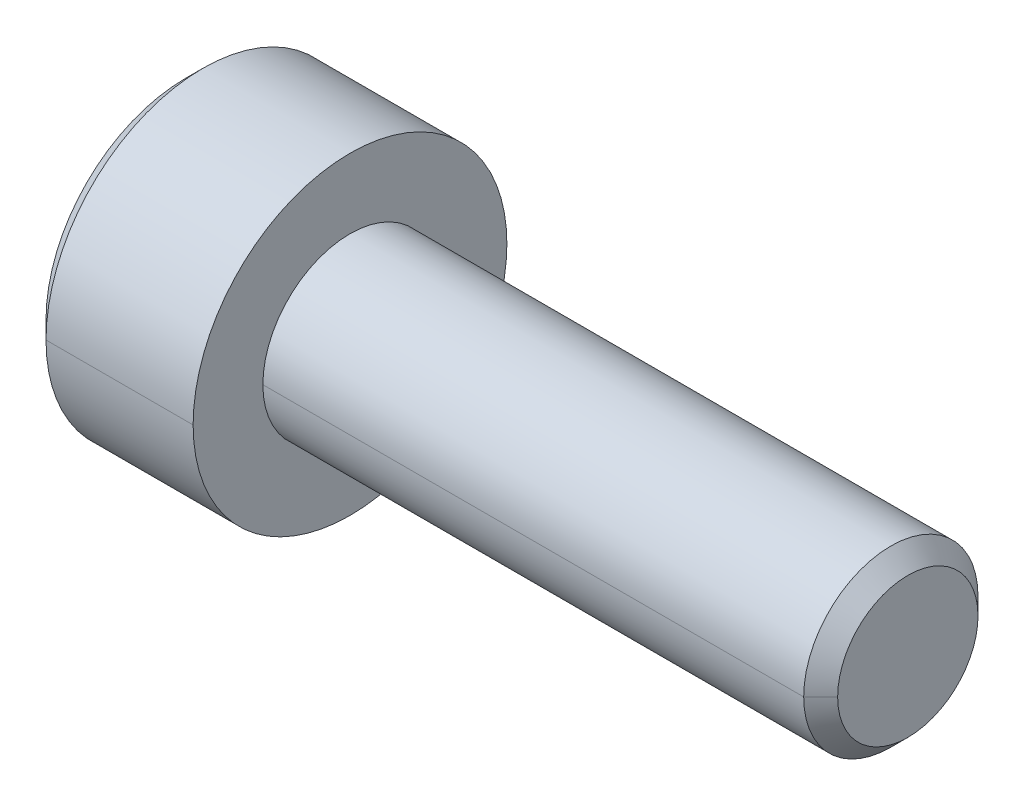
ISO-10303-21;
HEADER;
FILE_DESCRIPTION(('STEP AP214'),'2;1');
FILE_NAME('part.step','',(''),(''),'','','');
FILE_SCHEMA(('AUTOMOTIVE_DESIGN { 1 0 10303 214 1 1 1 1 }'));
ENDSEC;
DATA;
#1=APPLICATION_CONTEXT('core data for automotive mechanical design processes');
#2=APPLICATION_PROTOCOL_DEFINITION('international standard','automotive_design',2000,#1);
#3=PRODUCT_CONTEXT('',#1,'mechanical');
#4=PRODUCT('Part','Part','',(#3));
#5=PRODUCT_RELATED_PRODUCT_CATEGORY('part','',(#4));
#6=PRODUCT_DEFINITION_FORMATION('','',#4);
#7=PRODUCT_DEFINITION_CONTEXT('part definition',#1,'design');
#8=PRODUCT_DEFINITION('design','',#6,#7);
#9=PRODUCT_DEFINITION_SHAPE('','',#8);
#10=(LENGTH_UNIT() NAMED_UNIT(*) SI_UNIT(.MILLI.,.METRE.));
#11=(NAMED_UNIT(*) PLANE_ANGLE_UNIT() SI_UNIT($,.RADIAN.));
#12=(NAMED_UNIT(*) SI_UNIT($,.STERADIAN.) SOLID_ANGLE_UNIT());
#13=UNCERTAINTY_MEASURE_WITH_UNIT(LENGTH_MEASURE(1.E-05),#10,'distance_accuracy_value','');
#14=(GEOMETRIC_REPRESENTATION_CONTEXT(3) GLOBAL_UNCERTAINTY_ASSIGNED_CONTEXT((#13)) GLOBAL_UNIT_ASSIGNED_CONTEXT((#10,
#11,#12)) REPRESENTATION_CONTEXT('',''));
#15=CARTESIAN_POINT('',(0.,0.,0.));
#16=DIRECTION('',(0.,0.,1.));
#17=DIRECTION('',(1.,0.,0.));
#18=AXIS2_PLACEMENT_3D('',#15,#16,#17);
#19=CARTESIAN_POINT('',(-1.26,0.,0.));
#20=DIRECTION('',(1.,0.,0.));
#21=DIRECTION('',(0.,0.,-1.));
#22=AXIS2_PLACEMENT_3D('',#19,#20,#21);
#23=PLANE('',#22);
#24=CARTESIAN_POINT('',(-1.26,0.,0.));
#25=DIRECTION('',(-1.,0.,0.));
#26=DIRECTION('',(0.,0.,-1.));
#27=AXIS2_PLACEMENT_3D('',#24,#25,#26);
#28=CIRCLE('',#27,1.);
#29=CARTESIAN_POINT('',(-1.26,-0.866025403784422,-0.500000000000029));
#30=VERTEX_POINT('',#29);
#31=CARTESIAN_POINT('',(-1.26,-0.866025403784422,0.500000000000029));
#32=VERTEX_POINT('',#31);
#33=EDGE_CURVE('E11',#30,#32,#28,.T.);
#34=ORIENTED_EDGE('',*,*,#33,.F.);
#35=DIRECTION('',(0.,0.500000000000029,-0.866025403784422));
#36=VECTOR('',#35,1.);
#37=CARTESIAN_POINT('',(-1.26,-1.1547005383793,0.));
#38=LINE('',#37,#36);
#39=CARTESIAN_POINT('',(-1.26,-1.1547005383793,0.));
#40=VERTEX_POINT('',#39);
#41=EDGE_CURVE('E25',#40,#30,#38,.T.);
#42=ORIENTED_EDGE('',*,*,#41,.F.);
#43=DIRECTION('',(0.,-0.500000000000029,-0.866025403784422));
#44=VECTOR('',#43,1.);
#45=CARTESIAN_POINT('',(-1.26,-0.57735026918963,1.));
#46=LINE('',#45,#44);
#47=EDGE_CURVE('E355',#32,#40,#46,.T.);
#48=ORIENTED_EDGE('',*,*,#47,.F.);
#49=EDGE_LOOP('',(#34,#42,#48));
#50=FACE_BOUND('',#49,.T.);
#51=ADVANCED_FACE('F17',(#50),#23,.F.);
#52=CARTESIAN_POINT('',(-1.26,-0.57735026918963,1.));
#53=DIRECTION('',(0.,0.866025403784422,-0.500000000000029));
#54=DIRECTION('',(0.,0.500000000000029,0.866025403784422));
#55=AXIS2_PLACEMENT_3D('',#52,#53,#54);
#56=PLANE('',#55);
#57=DIRECTION('',(0.,-0.500000000000029,-0.866025403784422));
#58=VECTOR('',#57,1.);
#59=CARTESIAN_POINT('',(-2.36,-0.57735026918963,1.));
#60=LINE('',#59,#58);
#61=CARTESIAN_POINT('',(-2.36,-0.57735026918963,1.));
#62=VERTEX_POINT('',#61);
#63=CARTESIAN_POINT('',(-2.36,-1.1547005383793,0.));
#64=VERTEX_POINT('',#63);
#65=EDGE_CURVE('E350',#62,#64,#60,.T.);
#66=ORIENTED_EDGE('',*,*,#65,.F.);
#67=DIRECTION('',(-1.,0.,0.));
#68=VECTOR('',#67,1.);
#69=CARTESIAN_POINT('',(-1.26,-0.57735026918963,1.));
#70=LINE('',#69,#68);
#71=CARTESIAN_POINT('',(-1.26,-0.57735026918963,1.));
#72=VERTEX_POINT('',#71);
#73=EDGE_CURVE('E345',#72,#62,#70,.T.);
#74=ORIENTED_EDGE('',*,*,#73,.F.);
#75=DIRECTION('',(0.,-0.500000000000029,-0.866025403784422));
#76=VECTOR('',#75,1.);
#77=CARTESIAN_POINT('',(-1.26,-0.57735026918963,1.));
#78=LINE('',#77,#76);
#79=EDGE_CURVE('E340',#72,#32,#78,.T.);
#80=ORIENTED_EDGE('',*,*,#79,.T.);
#81=ORIENTED_EDGE('',*,*,#47,.T.);
#82=DIRECTION('',(-1.,0.,0.));
#83=VECTOR('',#82,1.);
#84=CARTESIAN_POINT('',(-1.26,-1.1547005383793,0.));
#85=LINE('',#84,#83);
#86=EDGE_CURVE('E336',#40,#64,#85,.T.);
#87=ORIENTED_EDGE('',*,*,#86,.T.);
#88=EDGE_LOOP('',(#66,#74,#80,#81,#87));
#89=FACE_BOUND('',#88,.T.);
#90=ADVANCED_FACE('F384',(#89),#56,.T.);
#91=CARTESIAN_POINT('',(-1.26,-1.1547005383793,0.));
#92=DIRECTION('',(0.,0.866025403784422,0.500000000000029));
#93=DIRECTION('',(0.,-0.500000000000029,0.866025403784422));
#94=AXIS2_PLACEMENT_3D('',#91,#92,#93);
#95=PLANE('',#94);
#96=DIRECTION('',(0.,0.500000000000029,-0.866025403784422));
#97=VECTOR('',#96,1.);
#98=CARTESIAN_POINT('',(-2.36,-1.1547005383793,0.));
#99=LINE('',#98,#97);
#100=CARTESIAN_POINT('',(-2.36,-0.57735026918963,-1.));
#101=VERTEX_POINT('',#100);
#102=EDGE_CURVE('E331',#64,#101,#99,.T.);
#103=ORIENTED_EDGE('',*,*,#102,.F.);
#104=ORIENTED_EDGE('',*,*,#86,.F.);
#105=ORIENTED_EDGE('',*,*,#41,.T.);
#106=DIRECTION('',(0.,0.500000000000029,-0.866025403784422));
#107=VECTOR('',#106,1.);
#108=CARTESIAN_POINT('',(-1.26,-1.1547005383793,0.));
#109=LINE('',#108,#107);
#110=CARTESIAN_POINT('',(-1.26,-0.57735026918963,-1.));
#111=VERTEX_POINT('',#110);
#112=EDGE_CURVE('E327',#30,#111,#109,.T.);
#113=ORIENTED_EDGE('',*,*,#112,.T.);
#114=DIRECTION('',(-1.,0.,0.));
#115=VECTOR('',#114,1.);
#116=CARTESIAN_POINT('',(-1.26,-0.57735026918963,-1.));
#117=LINE('',#116,#115);
#118=EDGE_CURVE('E323',#111,#101,#117,.T.);
#119=ORIENTED_EDGE('',*,*,#118,.T.);
#120=EDGE_LOOP('',(#103,#104,#105,#113,#119));
#121=FACE_BOUND('',#120,.T.);
#122=ADVANCED_FACE('F366',(#121),#95,.T.);
#123=CARTESIAN_POINT('',(-1.26,-0.57735026918963,-1.));
#124=DIRECTION('',(0.,0.,1.));
#125=DIRECTION('',(1.,0.,0.));
#126=AXIS2_PLACEMENT_3D('',#123,#124,#125);
#127=PLANE('',#126);
#128=DIRECTION('',(0.,1.,0.));
#129=VECTOR('',#128,1.);
#130=CARTESIAN_POINT('',(-2.36,-0.57735026918963,-1.));
#131=LINE('',#130,#129);
#132=CARTESIAN_POINT('',(-2.36,0.57735026918963,-1.));
#133=VERTEX_POINT('',#132);
#134=EDGE_CURVE('E318',#101,#133,#131,.T.);
#135=ORIENTED_EDGE('',*,*,#134,.F.);
#136=ORIENTED_EDGE('',*,*,#118,.F.);
#137=DIRECTION('',(0.,1.,0.));
#138=VECTOR('',#137,1.);
#139=CARTESIAN_POINT('',(-1.26,-0.57735026918963,-1.));
#140=LINE('',#139,#138);
#141=CARTESIAN_POINT('',(-1.26,0.,-1.));
#142=VERTEX_POINT('',#141);
#143=EDGE_CURVE('E314',#111,#142,#140,.T.);
#144=ORIENTED_EDGE('',*,*,#143,.T.);
#145=DIRECTION('',(0.,1.,0.));
#146=VECTOR('',#145,1.);
#147=CARTESIAN_POINT('',(-1.26,-0.57735026918963,-1.));
#148=LINE('',#147,#146);
#149=CARTESIAN_POINT('',(-1.26,0.57735026918963,-1.));
#150=VERTEX_POINT('',#149);
#151=EDGE_CURVE('E310',#142,#150,#148,.T.);
#152=ORIENTED_EDGE('',*,*,#151,.T.);
#153=DIRECTION('',(-1.,0.,0.));
#154=VECTOR('',#153,1.);
#155=CARTESIAN_POINT('',(-1.26,0.57735026918963,-1.));
#156=LINE('',#155,#154);
#157=EDGE_CURVE('E306',#150,#133,#156,.T.);
#158=ORIENTED_EDGE('',*,*,#157,.T.);
#159=EDGE_LOOP('',(#135,#136,#144,#152,#158));
#160=FACE_BOUND('',#159,.T.);
#161=ADVANCED_FACE('F379',(#160),#127,.T.);
#162=CARTESIAN_POINT('',(-1.26,0.57735026918963,-1.));
#163=DIRECTION('',(0.,-0.866025403784422,0.500000000000029));
#164=DIRECTION('',(0.,-0.500000000000029,-0.866025403784422));
#165=AXIS2_PLACEMENT_3D('',#162,#163,#164);
#166=PLANE('',#165);
#167=DIRECTION('',(0.,0.500000000000029,0.866025403784422));
#168=VECTOR('',#167,1.);
#169=CARTESIAN_POINT('',(-2.36,0.57735026918963,-1.));
#170=LINE('',#169,#168);
#171=CARTESIAN_POINT('',(-2.36,1.1547005383793,0.));
#172=VERTEX_POINT('',#171);
#173=EDGE_CURVE('E301',#133,#172,#170,.T.);
#174=ORIENTED_EDGE('',*,*,#173,.F.);
#175=ORIENTED_EDGE('',*,*,#157,.F.);
#176=DIRECTION('',(0.,0.500000000000029,0.866025403784422));
#177=VECTOR('',#176,1.);
#178=CARTESIAN_POINT('',(-1.26,0.57735026918963,-1.));
#179=LINE('',#178,#177);
#180=CARTESIAN_POINT('',(-1.26,0.866025403784442,-0.50000000000004));
#181=VERTEX_POINT('',#180);
#182=EDGE_CURVE('E297',#150,#181,#179,.T.);
#183=ORIENTED_EDGE('',*,*,#182,.T.);
#184=DIRECTION('',(0.,0.500000000000029,0.866025403784422));
#185=VECTOR('',#184,1.);
#186=CARTESIAN_POINT('',(-1.26,0.57735026918963,-1.));
#187=LINE('',#186,#185);
#188=CARTESIAN_POINT('',(-1.26,1.1547005383793,0.));
#189=VERTEX_POINT('',#188);
#190=EDGE_CURVE('E293',#181,#189,#187,.T.);
#191=ORIENTED_EDGE('',*,*,#190,.T.);
#192=DIRECTION('',(-1.,0.,0.));
#193=VECTOR('',#192,1.);
#194=CARTESIAN_POINT('',(-1.26,1.1547005383793,0.));
#195=LINE('',#194,#193);
#196=EDGE_CURVE('E289',#189,#172,#195,.T.);
#197=ORIENTED_EDGE('',*,*,#196,.T.);
#198=EDGE_LOOP('',(#174,#175,#183,#191,#197));
#199=FACE_BOUND('',#198,.T.);
#200=ADVANCED_FACE('F399',(#199),#166,.T.);
#201=CARTESIAN_POINT('',(-1.26,1.1547005383793,0.));
#202=DIRECTION('',(0.,-0.866025403784422,-0.500000000000029));
#203=DIRECTION('',(0.,0.500000000000029,-0.866025403784422));
#204=AXIS2_PLACEMENT_3D('',#201,#202,#203);
#205=PLANE('',#204);
#206=DIRECTION('',(0.,-0.500000000000029,0.866025403784422));
#207=VECTOR('',#206,1.);
#208=CARTESIAN_POINT('',(-2.36,1.1547005383793,0.));
#209=LINE('',#208,#207);
#210=CARTESIAN_POINT('',(-2.36,0.57735026918963,1.));
#211=VERTEX_POINT('',#210);
#212=EDGE_CURVE('E284',#172,#211,#209,.T.);
#213=ORIENTED_EDGE('',*,*,#212,.F.);
#214=ORIENTED_EDGE('',*,*,#196,.F.);
#215=DIRECTION('',(0.,-0.500000000000029,0.866025403784422));
#216=VECTOR('',#215,1.);
#217=CARTESIAN_POINT('',(-1.26,1.1547005383793,0.));
#218=LINE('',#217,#216);
#219=CARTESIAN_POINT('',(-1.26,0.866025403784422,0.500000000000029));
#220=VERTEX_POINT('',#219);
#221=EDGE_CURVE('E280',#189,#220,#218,.T.);
#222=ORIENTED_EDGE('',*,*,#221,.T.);
#223=DIRECTION('',(0.,-0.500000000000029,0.866025403784422));
#224=VECTOR('',#223,1.);
#225=CARTESIAN_POINT('',(-1.26,1.1547005383793,0.));
#226=LINE('',#225,#224);
#227=CARTESIAN_POINT('',(-1.26,0.57735026918963,1.));
#228=VERTEX_POINT('',#227);
#229=EDGE_CURVE('E276',#220,#228,#226,.T.);
#230=ORIENTED_EDGE('',*,*,#229,.T.);
#231=DIRECTION('',(-1.,0.,0.));
#232=VECTOR('',#231,1.);
#233=CARTESIAN_POINT('',(-1.26,0.57735026918963,1.));
#234=LINE('',#233,#232);
#235=EDGE_CURVE('E272',#228,#211,#234,.T.);
#236=ORIENTED_EDGE('',*,*,#235,.T.);
#237=EDGE_LOOP('',(#213,#214,#222,#230,#236));
#238=FACE_BOUND('',#237,.T.);
#239=ADVANCED_FACE('F402',(#238),#205,.T.);
#240=CARTESIAN_POINT('',(-1.26,0.57735026918963,1.));
#241=DIRECTION('',(0.,0.,-1.));
#242=DIRECTION('',(-1.,0.,0.));
#243=AXIS2_PLACEMENT_3D('',#240,#241,#242);
#244=PLANE('',#243);
#245=DIRECTION('',(0.,-1.,0.));
#246=VECTOR('',#245,1.);
#247=CARTESIAN_POINT('',(-2.36,0.57735026918963,1.));
#248=LINE('',#247,#246);
#249=EDGE_CURVE('E267',#211,#62,#248,.T.);
#250=ORIENTED_EDGE('',*,*,#249,.F.);
#251=ORIENTED_EDGE('',*,*,#235,.F.);
#252=DIRECTION('',(0.,-1.,0.));
#253=VECTOR('',#252,1.);
#254=CARTESIAN_POINT('',(-1.26,0.57735026918963,1.));
#255=LINE('',#254,#253);
#256=CARTESIAN_POINT('',(-1.26,0.,1.));
#257=VERTEX_POINT('',#256);
#258=EDGE_CURVE('E263',#228,#257,#255,.T.);
#259=ORIENTED_EDGE('',*,*,#258,.T.);
#260=DIRECTION('',(0.,-1.,0.));
#261=VECTOR('',#260,1.);
#262=CARTESIAN_POINT('',(-1.26,0.57735026918963,1.));
#263=LINE('',#262,#261);
#264=EDGE_CURVE('E258',#257,#72,#263,.T.);
#265=ORIENTED_EDGE('',*,*,#264,.T.);
#266=ORIENTED_EDGE('',*,*,#73,.T.);
#267=EDGE_LOOP('',(#250,#251,#259,#265,#266));
#268=FACE_BOUND('',#267,.T.);
#269=ADVANCED_FACE('F406',(#268),#244,.T.);
#270=CARTESIAN_POINT('',(-1.26,0.,0.));
#271=DIRECTION('',(1.,0.,0.));
#272=DIRECTION('',(0.,0.,-1.));
#273=AXIS2_PLACEMENT_3D('',#270,#271,#272);
#274=PLANE('',#273);
#275=CARTESIAN_POINT('',(-1.26,0.,0.));
#276=DIRECTION('',(-1.,0.,0.));
#277=DIRECTION('',(0.,0.,-1.));
#278=AXIS2_PLACEMENT_3D('',#275,#276,#277);
#279=CIRCLE('',#278,1.);
#280=EDGE_CURVE('E253',#32,#257,#279,.T.);
#281=ORIENTED_EDGE('',*,*,#280,.F.);
#282=ORIENTED_EDGE('',*,*,#79,.F.);
#283=ORIENTED_EDGE('',*,*,#264,.F.);
#284=EDGE_LOOP('',(#281,#282,#283));
#285=FACE_BOUND('',#284,.T.);
#286=ADVANCED_FACE('F410',(#285),#274,.F.);
#287=CARTESIAN_POINT('',(-1.26,0.,0.));
#288=DIRECTION('',(-1.,0.,0.));
#289=DIRECTION('',(0.,1.,0.));
#290=AXIS2_PLACEMENT_3D('',#287,#288,#289);
#291=CONICAL_SURFACE('',#290,1.,1.0471975511966);
#292=DIRECTION('',(-0.500000000000001,0.,-0.866025403784438));
#293=VECTOR('',#292,1.);
#294=CARTESIAN_POINT('',(-0.682649730810373,0.,0.));
#295=LINE('',#294,#293);
#296=CARTESIAN_POINT('',(-0.682649730810373,0.,0.));
#297=VERTEX_POINT('',#296);
#298=EDGE_CURVE('E248',#297,#142,#295,.T.);
#299=ORIENTED_EDGE('',*,*,#298,.T.);
#300=CARTESIAN_POINT('',(-1.26,0.,0.));
#301=DIRECTION('',(-1.,0.,0.));
#302=DIRECTION('',(0.,0.,-1.));
#303=AXIS2_PLACEMENT_3D('',#300,#301,#302);
#304=CIRCLE('',#303,1.);
#305=EDGE_CURVE('E243',#142,#30,#304,.T.);
#306=ORIENTED_EDGE('',*,*,#305,.T.);
#307=ORIENTED_EDGE('',*,*,#33,.T.);
#308=ORIENTED_EDGE('',*,*,#280,.T.);
#309=DIRECTION('',(-0.500000000000001,0.,0.866025403784438));
#310=VECTOR('',#309,1.);
#311=CARTESIAN_POINT('',(-0.682649730810373,0.,0.));
#312=LINE('',#311,#310);
#313=EDGE_CURVE('E238',#297,#257,#312,.T.);
#314=ORIENTED_EDGE('',*,*,#313,.F.);
#315=EDGE_LOOP('',(#299,#306,#307,#308,#314));
#316=FACE_BOUND('',#315,.T.);
#317=ADVANCED_FACE('F371',(#316),#291,.F.);
#318=CARTESIAN_POINT('',(-1.26,0.,0.));
#319=DIRECTION('',(-1.,0.,0.));
#320=DIRECTION('',(0.,-1.,0.));
#321=AXIS2_PLACEMENT_3D('',#318,#319,#320);
#322=CONICAL_SURFACE('',#321,1.,1.0471975511966);
#323=ORIENTED_EDGE('',*,*,#313,.T.);
#324=CARTESIAN_POINT('',(-1.26,0.,0.));
#325=DIRECTION('',(-1.,0.,0.));
#326=DIRECTION('',(0.,0.,-1.));
#327=AXIS2_PLACEMENT_3D('',#324,#325,#326);
#328=CIRCLE('',#327,1.);
#329=EDGE_CURVE('E233',#257,#220,#328,.T.);
#330=ORIENTED_EDGE('',*,*,#329,.T.);
#331=CARTESIAN_POINT('',(-1.26,0.,0.));
#332=DIRECTION('',(-1.,0.,0.));
#333=DIRECTION('',(0.,0.,-1.));
#334=AXIS2_PLACEMENT_3D('',#331,#332,#333);
#335=CIRCLE('',#334,1.);
#336=EDGE_CURVE('E228',#220,#181,#335,.T.);
#337=ORIENTED_EDGE('',*,*,#336,.T.);
#338=CARTESIAN_POINT('',(-1.26,0.,0.));
#339=DIRECTION('',(-1.,0.,0.));
#340=DIRECTION('',(0.,0.,-1.));
#341=AXIS2_PLACEMENT_3D('',#338,#339,#340);
#342=CIRCLE('',#341,1.);
#343=EDGE_CURVE('E223',#181,#142,#342,.T.);
#344=ORIENTED_EDGE('',*,*,#343,.T.);
#345=ORIENTED_EDGE('',*,*,#298,.F.);
#346=EDGE_LOOP('',(#323,#330,#337,#344,#345));
#347=FACE_BOUND('',#346,.T.);
#348=ADVANCED_FACE('F417',(#347),#322,.F.);
#349=CARTESIAN_POINT('',(-1.26,0.,0.));
#350=DIRECTION('',(1.,0.,0.));
#351=DIRECTION('',(0.,0.,-1.));
#352=AXIS2_PLACEMENT_3D('',#349,#350,#351);
#353=PLANE('',#352);
#354=ORIENTED_EDGE('',*,*,#343,.F.);
#355=ORIENTED_EDGE('',*,*,#182,.F.);
#356=ORIENTED_EDGE('',*,*,#151,.F.);
#357=EDGE_LOOP('',(#354,#355,#356));
#358=FACE_BOUND('',#357,.T.);
#359=ADVANCED_FACE('F420',(#358),#353,.F.);
#360=CARTESIAN_POINT('',(-1.26,0.,0.));
#361=DIRECTION('',(1.,0.,0.));
#362=DIRECTION('',(0.,0.,-1.));
#363=AXIS2_PLACEMENT_3D('',#360,#361,#362);
#364=PLANE('',#363);
#365=ORIENTED_EDGE('',*,*,#336,.F.);
#366=ORIENTED_EDGE('',*,*,#221,.F.);
#367=ORIENTED_EDGE('',*,*,#190,.F.);
#368=EDGE_LOOP('',(#365,#366,#367));
#369=FACE_BOUND('',#368,.T.);
#370=ADVANCED_FACE('F424',(#369),#364,.F.);
#371=CARTESIAN_POINT('',(-1.26,0.,0.));
#372=DIRECTION('',(1.,0.,0.));
#373=DIRECTION('',(0.,0.,-1.));
#374=AXIS2_PLACEMENT_3D('',#371,#372,#373);
#375=PLANE('',#374);
#376=ORIENTED_EDGE('',*,*,#329,.F.);
#377=ORIENTED_EDGE('',*,*,#258,.F.);
#378=ORIENTED_EDGE('',*,*,#229,.F.);
#379=EDGE_LOOP('',(#376,#377,#378));
#380=FACE_BOUND('',#379,.T.);
#381=ADVANCED_FACE('F428',(#380),#375,.F.);
#382=CARTESIAN_POINT('',(-1.26,0.,0.));
#383=DIRECTION('',(1.,0.,0.));
#384=DIRECTION('',(0.,0.,-1.));
#385=AXIS2_PLACEMENT_3D('',#382,#383,#384);
#386=PLANE('',#385);
#387=ORIENTED_EDGE('',*,*,#305,.F.);
#388=ORIENTED_EDGE('',*,*,#143,.F.);
#389=ORIENTED_EDGE('',*,*,#112,.F.);
#390=EDGE_LOOP('',(#387,#388,#389));
#391=FACE_BOUND('',#390,.T.);
#392=ADVANCED_FACE('F375',(#391),#386,.F.);
#393=CARTESIAN_POINT('',(-2.36,0.,0.));
#394=DIRECTION('',(1.,0.,0.));
#395=DIRECTION('',(0.,0.,-1.));
#396=AXIS2_PLACEMENT_3D('',#393,#394,#395);
#397=PLANE('',#396);
#398=CARTESIAN_POINT('',(-2.36,0.,0.));
#399=DIRECTION('',(1.,0.,0.));
#400=DIRECTION('',(0.,0.,-1.));
#401=AXIS2_PLACEMENT_3D('',#398,#399,#400);
#402=CIRCLE('',#401,2.);
#403=CARTESIAN_POINT('',(-2.36,0.,2.));
#404=VERTEX_POINT('',#403);
#405=CARTESIAN_POINT('',(-2.36,0.,-2.));
#406=VERTEX_POINT('',#405);
#407=EDGE_CURVE('E218',#404,#406,#402,.T.);
#408=ORIENTED_EDGE('',*,*,#407,.F.);
#409=CARTESIAN_POINT('',(-2.36,0.,0.));
#410=DIRECTION('',(1.,0.,0.));
#411=DIRECTION('',(0.,0.,-1.));
#412=AXIS2_PLACEMENT_3D('',#409,#410,#411);
#413=CIRCLE('',#412,2.);
#414=EDGE_CURVE('E213',#406,#404,#413,.T.);
#415=ORIENTED_EDGE('',*,*,#414,.F.);
#416=EDGE_LOOP('',(#408,#415));
#417=FACE_BOUND('',#416,.T.);
#418=ORIENTED_EDGE('',*,*,#249,.T.);
#419=ORIENTED_EDGE('',*,*,#65,.T.);
#420=ORIENTED_EDGE('',*,*,#102,.T.);
#421=ORIENTED_EDGE('',*,*,#134,.T.);
#422=ORIENTED_EDGE('',*,*,#173,.T.);
#423=ORIENTED_EDGE('',*,*,#212,.T.);
#424=EDGE_LOOP('',(#418,#419,#420,#421,#422,#423));
#425=FACE_BOUND('',#424,.T.);
#426=ADVANCED_FACE('F381',(#417,#425),#397,.F.);
#427=CARTESIAN_POINT('',(-2.36,0.,0.));
#428=DIRECTION('',(1.,0.,0.));
#429=DIRECTION('',(0.,-1.,0.));
#430=AXIS2_PLACEMENT_3D('',#427,#428,#429);
#431=CONICAL_SURFACE('',#430,2.,0.785398163397448);
#432=DIRECTION('',(0.707106781186548,0.,0.707106781186548));
#433=VECTOR('',#432,1.);
#434=CARTESIAN_POINT('',(-2.36,0.,2.));
#435=LINE('',#434,#433);
#436=CARTESIAN_POINT('',(-2.11,0.,2.25));
#437=VERTEX_POINT('',#436);
#438=EDGE_CURVE('E209',#404,#437,#435,.T.);
#439=ORIENTED_EDGE('',*,*,#438,.T.);
#440=CARTESIAN_POINT('',(-2.11,0.,0.));
#441=DIRECTION('',(1.,0.,0.));
#442=DIRECTION('',(0.,0.,-1.));
#443=AXIS2_PLACEMENT_3D('',#440,#441,#442);
#444=CIRCLE('',#443,2.25);
#445=CARTESIAN_POINT('',(-2.11,0.,-2.25));
#446=VERTEX_POINT('',#445);
#447=EDGE_CURVE('E204',#446,#437,#444,.T.);
#448=ORIENTED_EDGE('',*,*,#447,.F.);
#449=DIRECTION('',(0.707106781186548,0.,-0.707106781186548));
#450=VECTOR('',#449,1.);
#451=CARTESIAN_POINT('',(-2.36,0.,-2.));
#452=LINE('',#451,#450);
#453=EDGE_CURVE('E199',#406,#446,#452,.T.);
#454=ORIENTED_EDGE('',*,*,#453,.F.);
#455=ORIENTED_EDGE('',*,*,#414,.T.);
#456=EDGE_LOOP('',(#439,#448,#454,#455));
#457=FACE_BOUND('',#456,.T.);
#458=ADVANCED_FACE('F437',(#457),#431,.T.);
#459=CARTESIAN_POINT('',(-2.36,0.,0.));
#460=DIRECTION('',(1.,0.,0.));
#461=DIRECTION('',(0.,1.,0.));
#462=AXIS2_PLACEMENT_3D('',#459,#460,#461);
#463=CONICAL_SURFACE('',#462,2.,0.785398163397448);
#464=ORIENTED_EDGE('',*,*,#438,.F.);
#465=ORIENTED_EDGE('',*,*,#407,.T.);
#466=ORIENTED_EDGE('',*,*,#453,.T.);
#467=CARTESIAN_POINT('',(-2.11,0.,0.));
#468=DIRECTION('',(1.,0.,0.));
#469=DIRECTION('',(0.,0.,-1.));
#470=AXIS2_PLACEMENT_3D('',#467,#468,#469);
#471=CIRCLE('',#470,2.25);
#472=EDGE_CURVE('E194',#437,#446,#471,.T.);
#473=ORIENTED_EDGE('',*,*,#472,.F.);
#474=EDGE_LOOP('',(#464,#465,#466,#473));
#475=FACE_BOUND('',#474,.T.);
#476=ADVANCED_FACE('F441',(#475),#463,.T.);
#477=CARTESIAN_POINT('',(8.,0.,0.));
#478=DIRECTION('',(1.,0.,0.));
#479=DIRECTION('',(0.,1.,0.));
#480=AXIS2_PLACEMENT_3D('',#477,#478,#479);
#481=CYLINDRICAL_SURFACE('',#480,2.25);
#482=DIRECTION('',(1.,0.,0.));
#483=VECTOR('',#482,1.);
#484=CARTESIAN_POINT('',(-2.11,0.,2.25));
#485=LINE('',#484,#483);
#486=CARTESIAN_POINT('',(0.,0.,2.25));
#487=VERTEX_POINT('',#486);
#488=EDGE_CURVE('E189',#437,#487,#485,.T.);
#489=ORIENTED_EDGE('',*,*,#488,.F.);
#490=ORIENTED_EDGE('',*,*,#472,.T.);
#491=DIRECTION('',(1.,0.,0.));
#492=VECTOR('',#491,1.);
#493=CARTESIAN_POINT('',(-2.11,0.,-2.25));
#494=LINE('',#493,#492);
#495=CARTESIAN_POINT('',(0.,0.,-2.25));
#496=VERTEX_POINT('',#495);
#497=EDGE_CURVE('E185',#446,#496,#494,.T.);
#498=ORIENTED_EDGE('',*,*,#497,.T.);
#499=CARTESIAN_POINT('',(0.,0.,0.));
#500=DIRECTION('',(1.,0.,0.));
#501=DIRECTION('',(0.,0.,-1.));
#502=AXIS2_PLACEMENT_3D('',#499,#500,#501);
#503=CIRCLE('',#502,2.25);
#504=EDGE_CURVE('E180',#487,#496,#503,.T.);
#505=ORIENTED_EDGE('',*,*,#504,.F.);
#506=EDGE_LOOP('',(#489,#490,#498,#505));
#507=FACE_BOUND('',#506,.T.);
#508=ADVANCED_FACE('F445',(#507),#481,.T.);
#509=CARTESIAN_POINT('',(0.,2.25,0.));
#510=DIRECTION('',(-1.,0.,0.));
#511=DIRECTION('',(0.,0.,1.));
#512=AXIS2_PLACEMENT_3D('',#509,#510,#511);
#513=PLANE('',#512);
#514=CARTESIAN_POINT('',(0.,0.,0.));
#515=DIRECTION('',(1.,0.,0.));
#516=DIRECTION('',(0.,0.,-1.));
#517=AXIS2_PLACEMENT_3D('',#514,#515,#516);
#518=CIRCLE('',#517,1.25);
#519=CARTESIAN_POINT('',(0.,0.,1.25));
#520=VERTEX_POINT('',#519);
#521=CARTESIAN_POINT('',(0.,0.,-1.25));
#522=VERTEX_POINT('',#521);
#523=EDGE_CURVE('E175',#520,#522,#518,.T.);
#524=ORIENTED_EDGE('',*,*,#523,.F.);
#525=CARTESIAN_POINT('',(0.,0.,0.));
#526=DIRECTION('',(1.,0.,0.));
#527=DIRECTION('',(0.,0.,-1.));
#528=AXIS2_PLACEMENT_3D('',#525,#526,#527);
#529=CIRCLE('',#528,1.25);
#530=EDGE_CURVE('E170',#522,#520,#529,.T.);
#531=ORIENTED_EDGE('',*,*,#530,.F.);
#532=EDGE_LOOP('',(#524,#531));
#533=FACE_BOUND('',#532,.T.);
#534=CARTESIAN_POINT('',(0.,0.,0.));
#535=DIRECTION('',(1.,0.,0.));
#536=DIRECTION('',(0.,0.,-1.));
#537=AXIS2_PLACEMENT_3D('',#534,#535,#536);
#538=CIRCLE('',#537,2.25);
#539=EDGE_CURVE('E165',#496,#487,#538,.T.);
#540=ORIENTED_EDGE('',*,*,#539,.T.);
#541=ORIENTED_EDGE('',*,*,#504,.T.);
#542=EDGE_LOOP('',(#540,#541));
#543=FACE_BOUND('',#542,.T.);
#544=ADVANCED_FACE('F449',(#533,#543),#513,.F.);
#545=CARTESIAN_POINT('',(8.,0.,0.));
#546=DIRECTION('',(1.,0.,0.));
#547=DIRECTION('',(0.,-1.,0.));
#548=AXIS2_PLACEMENT_3D('',#545,#546,#547);
#549=CYLINDRICAL_SURFACE('',#548,2.25);
#550=ORIENTED_EDGE('',*,*,#488,.T.);
#551=ORIENTED_EDGE('',*,*,#539,.F.);
#552=ORIENTED_EDGE('',*,*,#497,.F.);
#553=ORIENTED_EDGE('',*,*,#447,.T.);
#554=EDGE_LOOP('',(#550,#551,#552,#553));
#555=FACE_BOUND('',#554,.T.);
#556=ADVANCED_FACE('F453',(#555),#549,.T.);
#557=CARTESIAN_POINT('',(8.,0.,0.));
#558=DIRECTION('',(1.,0.,0.));
#559=DIRECTION('',(0.,-1.,0.));
#560=AXIS2_PLACEMENT_3D('',#557,#558,#559);
#561=CYLINDRICAL_SURFACE('',#560,1.25);
#562=DIRECTION('',(1.,0.,0.));
#563=VECTOR('',#562,1.);
#564=CARTESIAN_POINT('',(0.,0.,1.25));
#565=LINE('',#564,#563);
#566=CARTESIAN_POINT('',(7.7565,0.,1.25));
#567=VERTEX_POINT('',#566);
#568=EDGE_CURVE('E161',#520,#567,#565,.T.);
#569=ORIENTED_EDGE('',*,*,#568,.T.);
#570=CARTESIAN_POINT('',(7.7565,0.,0.));
#571=DIRECTION('',(1.,0.,0.));
#572=DIRECTION('',(0.,0.,-1.));
#573=AXIS2_PLACEMENT_3D('',#570,#571,#572);
#574=CIRCLE('',#573,1.25);
#575=CARTESIAN_POINT('',(7.7565,0.,-1.25));
#576=VERTEX_POINT('',#575);
#577=EDGE_CURVE('E139',#576,#567,#574,.T.);
#578=ORIENTED_EDGE('',*,*,#577,.F.);
#579=DIRECTION('',(1.,0.,0.));
#580=VECTOR('',#579,1.);
#581=CARTESIAN_POINT('',(0.,0.,-1.25));
#582=LINE('',#581,#580);
#583=EDGE_CURVE('E153',#522,#576,#582,.T.);
#584=ORIENTED_EDGE('',*,*,#583,.F.);
#585=ORIENTED_EDGE('',*,*,#530,.T.);
#586=EDGE_LOOP('',(#569,#578,#584,#585));
#587=FACE_BOUND('',#586,.T.);
#588=ADVANCED_FACE('F457',(#587),#561,.T.);
#589=CARTESIAN_POINT('',(8.,0.,0.));
#590=DIRECTION('',(1.,0.,0.));
#591=DIRECTION('',(0.,1.,0.));
#592=AXIS2_PLACEMENT_3D('',#589,#590,#591);
#593=CYLINDRICAL_SURFACE('',#592,1.25);
#594=ORIENTED_EDGE('',*,*,#568,.F.);
#595=ORIENTED_EDGE('',*,*,#523,.T.);
#596=ORIENTED_EDGE('',*,*,#583,.T.);
#597=CARTESIAN_POINT('',(7.7565,0.,0.));
#598=DIRECTION('',(1.,0.,0.));
#599=DIRECTION('',(0.,0.,-1.));
#600=AXIS2_PLACEMENT_3D('',#597,#598,#599);
#601=CIRCLE('',#600,1.25);
#602=EDGE_CURVE('E149',#567,#576,#601,.T.);
#603=ORIENTED_EDGE('',*,*,#602,.F.);
#604=EDGE_LOOP('',(#594,#595,#596,#603));
#605=FACE_BOUND('',#604,.T.);
#606=ADVANCED_FACE('F461',(#605),#593,.T.);
#607=CARTESIAN_POINT('',(7.7565,0.,0.));
#608=DIRECTION('',(-1.,0.,0.));
#609=DIRECTION('',(0.,1.,0.));
#610=AXIS2_PLACEMENT_3D('',#607,#608,#609);
#611=CONICAL_SURFACE('',#610,1.25,0.785398163397449);
#612=DIRECTION('',(-0.707106781186547,0.,-0.707106781186548));
#613=VECTOR('',#612,1.);
#614=CARTESIAN_POINT('',(8.,0.,-1.0065));
#615=LINE('',#614,#613);
#616=CARTESIAN_POINT('',(8.,0.,-1.0065));
#617=VERTEX_POINT('',#616);
#618=EDGE_CURVE('E130',#617,#576,#615,.T.);
#619=ORIENTED_EDGE('',*,*,#618,.F.);
#620=CARTESIAN_POINT('',(8.,0.,0.));
#621=DIRECTION('',(1.,0.,0.));
#622=DIRECTION('',(0.,0.,-1.));
#623=AXIS2_PLACEMENT_3D('',#620,#621,#622);
#624=CIRCLE('',#623,1.0065);
#625=CARTESIAN_POINT('',(8.,0.,1.0065));
#626=VERTEX_POINT('',#625);
#627=EDGE_CURVE('E122',#626,#617,#624,.T.);
#628=ORIENTED_EDGE('',*,*,#627,.F.);
#629=DIRECTION('',(-0.707106781186547,0.,0.707106781186548));
#630=VECTOR('',#629,1.);
#631=CARTESIAN_POINT('',(8.,0.,1.0065));
#632=LINE('',#631,#630);
#633=EDGE_CURVE('E127',#626,#567,#632,.T.);
#634=ORIENTED_EDGE('',*,*,#633,.T.);
#635=ORIENTED_EDGE('',*,*,#602,.T.);
#636=EDGE_LOOP('',(#619,#628,#634,#635));
#637=FACE_BOUND('',#636,.T.);
#638=ADVANCED_FACE('F124',(#637),#611,.T.);
#639=CARTESIAN_POINT('',(7.7565,0.,0.));
#640=DIRECTION('',(-1.,0.,0.));
#641=DIRECTION('',(0.,-1.,0.));
#642=AXIS2_PLACEMENT_3D('',#639,#640,#641);
#643=CONICAL_SURFACE('',#642,1.25,0.785398163397449);
#644=ORIENTED_EDGE('',*,*,#618,.T.);
#645=ORIENTED_EDGE('',*,*,#577,.T.);
#646=ORIENTED_EDGE('',*,*,#633,.F.);
#647=CARTESIAN_POINT('',(8.,0.,0.));
#648=DIRECTION('',(1.,0.,0.));
#649=DIRECTION('',(0.,0.,-1.));
#650=AXIS2_PLACEMENT_3D('',#647,#648,#649);
#651=CIRCLE('',#650,1.0065);
#652=EDGE_CURVE('E134',#617,#626,#651,.T.);
#653=ORIENTED_EDGE('',*,*,#652,.F.);
#654=EDGE_LOOP('',(#644,#645,#646,#653));
#655=FACE_BOUND('',#654,.T.);
#656=ADVANCED_FACE('F138',(#655),#643,.T.);
#657=CARTESIAN_POINT('',(8.,1.0065,0.));
#658=DIRECTION('',(-1.,0.,0.));
#659=DIRECTION('',(0.,0.,1.));
#660=AXIS2_PLACEMENT_3D('',#657,#658,#659);
#661=PLANE('',#660);
#662=ORIENTED_EDGE('',*,*,#652,.T.);
#663=ORIENTED_EDGE('',*,*,#627,.T.);
#664=EDGE_LOOP('',(#662,#663));
#665=FACE_BOUND('',#664,.T.);
#666=ADVANCED_FACE('F135',(#665),#661,.F.);
#667=CLOSED_SHELL('',(#51,#90,#122,#161,#200,#239,#269,#286,#317,#348,#359,#370,#381,#392,#426,
#458,#476,#508,#544,#556,#588,#606,#638,#656,#666));
#668=MANIFOLD_SOLID_BREP('B1',#667);
#669=ADVANCED_BREP_SHAPE_REPRESENTATION('',(#18,#668),#14);
#670=SHAPE_DEFINITION_REPRESENTATION(#9,#669);
ENDSEC;
END-ISO-10303-21;
